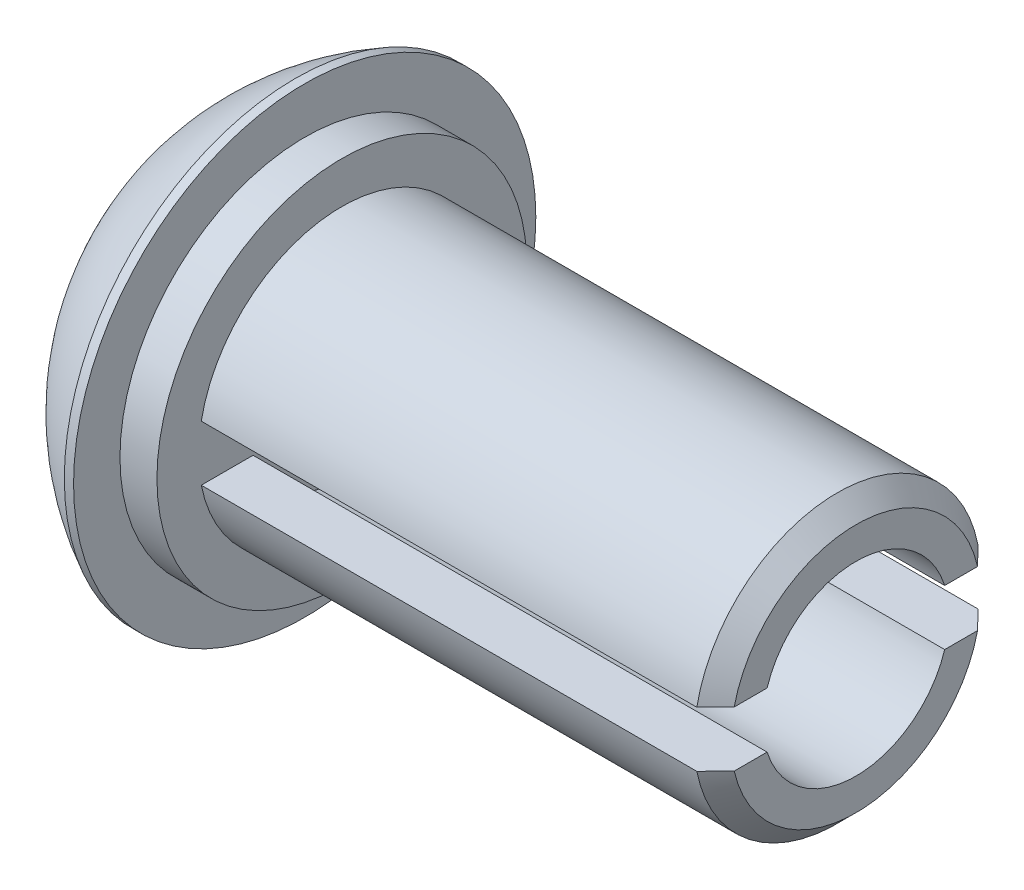
ISO-10303-21;
HEADER;
FILE_DESCRIPTION(('STEP AP214'),'2;1');
FILE_NAME('part.step','',(''),(''),'','','');
FILE_SCHEMA(('AUTOMOTIVE_DESIGN { 1 0 10303 214 1 1 1 1 }'));
ENDSEC;
DATA;
#1=APPLICATION_CONTEXT('core data for automotive mechanical design processes');
#2=APPLICATION_PROTOCOL_DEFINITION('international standard','automotive_design',2000,#1);
#3=PRODUCT_CONTEXT('',#1,'mechanical');
#4=PRODUCT('Part','Part','',(#3));
#5=PRODUCT_RELATED_PRODUCT_CATEGORY('part','',(#4));
#6=PRODUCT_DEFINITION_FORMATION('','',#4);
#7=PRODUCT_DEFINITION_CONTEXT('part definition',#1,'design');
#8=PRODUCT_DEFINITION('design','',#6,#7);
#9=PRODUCT_DEFINITION_SHAPE('','',#8);
#10=(LENGTH_UNIT() NAMED_UNIT(*) SI_UNIT(.MILLI.,.METRE.));
#11=(NAMED_UNIT(*) PLANE_ANGLE_UNIT() SI_UNIT($,.RADIAN.));
#12=(NAMED_UNIT(*) SI_UNIT($,.STERADIAN.) SOLID_ANGLE_UNIT());
#13=UNCERTAINTY_MEASURE_WITH_UNIT(LENGTH_MEASURE(1.E-05),#10,'distance_accuracy_value','');
#14=(GEOMETRIC_REPRESENTATION_CONTEXT(3) GLOBAL_UNCERTAINTY_ASSIGNED_CONTEXT((#13)) GLOBAL_UNIT_ASSIGNED_CONTEXT((#10,
#11,#12)) REPRESENTATION_CONTEXT('',''));
#15=CARTESIAN_POINT('',(0.,0.,0.));
#16=DIRECTION('',(0.,0.,1.));
#17=DIRECTION('',(1.,0.,0.));
#18=AXIS2_PLACEMENT_3D('',#15,#16,#17);
#19=CARTESIAN_POINT('',(0.,0.,0.));
#20=DIRECTION('',(-1.,0.,0.));
#21=DIRECTION('',(0.,0.,1.));
#22=AXIS2_PLACEMENT_3D('',#19,#20,#21);
#23=CYLINDRICAL_SURFACE('',#22,1.9685);
#24=CARTESIAN_POINT('',(9.40054,0.,0.));
#25=DIRECTION('',(-1.,0.,0.));
#26=DIRECTION('',(0.,0.,1.));
#27=AXIS2_PLACEMENT_3D('',#24,#25,#26);
#28=CIRCLE('',#27,1.9685);
#29=CARTESIAN_POINT('',(9.40054,0.381000000000001,1.93127710336968));
#30=VERTEX_POINT('',#29);
#31=CARTESIAN_POINT('',(9.40054,0.381000000000001,-1.93127710336968));
#32=VERTEX_POINT('',#31);
#33=EDGE_CURVE('E164',#30,#32,#28,.T.);
#34=ORIENTED_EDGE('',*,*,#33,.T.);
#35=DIRECTION('',(-1.,0.,0.));
#36=VECTOR('',#35,1.);
#37=CARTESIAN_POINT('',(0.,0.381000000000001,-1.93127710336968));
#38=LINE('',#37,#36);
#39=CARTESIAN_POINT('',(2.59334,0.381000000000001,-1.93127710336968));
#40=VERTEX_POINT('',#39);
#41=EDGE_CURVE('E229',#32,#40,#38,.T.);
#42=ORIENTED_EDGE('',*,*,#41,.T.);
#43=CARTESIAN_POINT('',(2.59334,0.,0.));
#44=DIRECTION('',(-1.,0.,0.));
#45=DIRECTION('',(0.,0.,1.));
#46=AXIS2_PLACEMENT_3D('',#43,#44,#45);
#47=CIRCLE('',#46,1.9685);
#48=CARTESIAN_POINT('',(2.59334,0.381000000000001,1.93127710336968));
#49=VERTEX_POINT('',#48);
#50=EDGE_CURVE('E142',#49,#40,#47,.T.);
#51=ORIENTED_EDGE('',*,*,#50,.F.);
#52=DIRECTION('',(-1.,0.,0.));
#53=VECTOR('',#52,1.);
#54=CARTESIAN_POINT('',(0.,0.381000000000001,1.93127710336968));
#55=LINE('',#54,#53);
#56=EDGE_CURVE('E220',#49,#30,#55,.F.);
#57=ORIENTED_EDGE('',*,*,#56,.T.);
#58=EDGE_LOOP('',(#34,#42,#51,#57));
#59=FACE_BOUND('',#58,.T.);
#60=ADVANCED_FACE('F30',(#59),#23,.T.);
#61=CARTESIAN_POINT('',(9.65454,1.9685,0.));
#62=DIRECTION('',(-1.,0.,0.));
#63=DIRECTION('',(0.,0.,1.));
#64=AXIS2_PLACEMENT_3D('',#61,#62,#63);
#65=PLANE('',#64);
#66=CARTESIAN_POINT('',(9.65454,0.,0.));
#67=DIRECTION('',(-1.,0.,0.));
#68=DIRECTION('',(0.,0.,1.));
#69=AXIS2_PLACEMENT_3D('',#66,#67,#68);
#70=CIRCLE('',#69,1.7145);
#71=CARTESIAN_POINT('',(9.65454,0.381000000000001,-1.6716307157982));
#72=VERTEX_POINT('',#71);
#73=CARTESIAN_POINT('',(9.65454,0.381000000000001,1.6716307157982));
#74=VERTEX_POINT('',#73);
#75=EDGE_CURVE('E167',#72,#74,#70,.F.);
#76=ORIENTED_EDGE('',*,*,#75,.T.);
#77=DIRECTION('',(0.,0.,1.));
#78=VECTOR('',#77,1.);
#79=CARTESIAN_POINT('',(9.65454,0.381000000000001,-3.175));
#80=LINE('',#79,#78);
#81=CARTESIAN_POINT('',(9.65454,0.381000000000001,1.21970071418776));
#82=VERTEX_POINT('',#81);
#83=EDGE_CURVE('E127',#82,#74,#80,.T.);
#84=ORIENTED_EDGE('',*,*,#83,.F.);
#85=CARTESIAN_POINT('',(9.65454,0.,0.));
#86=DIRECTION('',(-1.,0.,0.));
#87=DIRECTION('',(0.,0.,1.));
#88=AXIS2_PLACEMENT_3D('',#85,#86,#87);
#89=CIRCLE('',#88,1.277822692);
#90=CARTESIAN_POINT('',(9.65454,0.381000000000001,-1.21970071418776));
#91=VERTEX_POINT('',#90);
#92=EDGE_CURVE('E132',#82,#91,#89,.T.);
#93=ORIENTED_EDGE('',*,*,#92,.T.);
#94=EDGE_CURVE('E234',#72,#91,#80,.T.);
#95=ORIENTED_EDGE('',*,*,#94,.F.);
#96=EDGE_LOOP('',(#76,#84,#93,#95));
#97=FACE_BOUND('',#96,.T.);
#98=ADVANCED_FACE('F191',(#97),#65,.F.);
#99=CARTESIAN_POINT('',(0.,0.,0.));
#100=DIRECTION('',(-1.,0.,0.));
#101=DIRECTION('',(0.,0.,1.));
#102=AXIS2_PLACEMENT_3D('',#99,#100,#101);
#103=CYLINDRICAL_SURFACE('',#102,1.277822692);
#104=CARTESIAN_POINT('',(2.59334,0.,0.));
#105=DIRECTION('',(-1.,0.,0.));
#106=DIRECTION('',(0.,0.,1.));
#107=AXIS2_PLACEMENT_3D('',#104,#105,#106);
#108=CIRCLE('',#107,1.277822692);
#109=CARTESIAN_POINT('',(2.59334,0.381000000000001,1.21970071418776));
#110=VERTEX_POINT('',#109);
#111=CARTESIAN_POINT('',(2.59334,0.381000000000001,-1.21970071418776));
#112=VERTEX_POINT('',#111);
#113=EDGE_CURVE('E133',#110,#112,#108,.T.);
#114=ORIENTED_EDGE('',*,*,#113,.T.);
#115=DIRECTION('',(-1.,0.,0.));
#116=VECTOR('',#115,1.);
#117=CARTESIAN_POINT('',(0.,0.381000000000001,-1.21970071418776));
#118=LINE('',#117,#116);
#119=EDGE_CURVE('E250',#112,#91,#118,.F.);
#120=ORIENTED_EDGE('',*,*,#119,.T.);
#121=ORIENTED_EDGE('',*,*,#92,.F.);
#122=DIRECTION('',(-1.,0.,0.));
#123=VECTOR('',#122,1.);
#124=CARTESIAN_POINT('',(0.,0.381000000000001,1.21970071418776));
#125=LINE('',#124,#123);
#126=EDGE_CURVE('E248',#82,#110,#125,.T.);
#127=ORIENTED_EDGE('',*,*,#126,.T.);
#128=EDGE_LOOP('',(#114,#120,#121,#127));
#129=FACE_BOUND('',#128,.T.);
#130=ADVANCED_FACE('F198',(#129),#103,.F.);
#131=CARTESIAN_POINT('',(9.40054,0.,0.));
#132=DIRECTION('',(-1.,0.,0.));
#133=DIRECTION('',(0.,0.,1.));
#134=AXIS2_PLACEMENT_3D('',#131,#132,#133);
#135=CONICAL_SURFACE('',#134,1.9685,0.785398163397453);
#136=CARTESIAN_POINT('',(7.03322897598782,0.381000000000001,-4.31903880926599));
#137=CARTESIAN_POINT('',(7.1873440458186,0.381000000000001,-4.16431959154484));
#138=CARTESIAN_POINT('',(7.34143234496122,0.381000000000001,-4.00957365651349));
#139=CARTESIAN_POINT('',(7.64952770519312,0.381000000000001,-3.69998038506975));
#140=CARTESIAN_POINT('',(7.80353476017357,0.381000000000001,-3.54513304257858));
#141=CARTESIAN_POINT('',(8.11166528987143,0.381000000000001,-3.23506214672193));
#142=CARTESIAN_POINT('',(8.26578855750567,0.381000000000001,-3.07983838754255));
#143=CARTESIAN_POINT('',(8.5738243328161,0.381000000000001,-2.76920172554496));
#144=CARTESIAN_POINT('',(8.72773685352095,0.381000000000001,-2.61378883565545));
#145=CARTESIAN_POINT('',(9.0254961162365,0.381000000000001,-2.31247329107425));
#146=CARTESIAN_POINT('',(9.16936355869765,0.381000000000001,-2.1665910940783));
#147=CARTESIAN_POINT('',(9.45661240637948,0.381000000000001,-1.87429440553616));
#148=CARTESIAN_POINT('',(9.59999371640273,0.381000000000001,-1.72787982019204));
#149=CARTESIAN_POINT('',(9.81419045750005,0.381000000000001,-1.50754208565216));
#150=CARTESIAN_POINT('',(9.88540974031281,0.381000000000001,-1.43401210576863));
#151=CARTESIAN_POINT('',(10.0274245535608,0.381000000000001,-1.28653366680181));
#152=CARTESIAN_POINT('',(10.0982200529765,0.381000000000001,-1.21258517783748));
#153=CARTESIAN_POINT('',(10.2390892869109,0.381000000000001,-1.06404736885032));
#154=CARTESIAN_POINT('',(10.3091632584408,0.381000000000001,-0.989458275048335));
#155=CARTESIAN_POINT('',(10.4132743115276,0.381000000000001,-0.876658591297751));
#156=CARTESIAN_POINT('',(10.4478093442954,0.381000000000001,-0.83890826909454));
#157=CARTESIAN_POINT('',(10.51639097876,0.381000000000001,-0.762967228003849));
#158=CARTESIAN_POINT('',(10.5504376011495,0.381000000000001,-0.724776527898345));
#159=CARTESIAN_POINT('',(10.602948988222,0.381000000000001,-0.664712321848871));
#160=CARTESIAN_POINT('',(10.6216699576723,0.381000000000001,-0.64306305369018));
#161=CARTESIAN_POINT('',(10.6588068328657,0.381000000000001,-0.599500071332568));
#162=CARTESIAN_POINT('',(10.6772227084605,0.381000000000001,-0.577586331364926));
#163=CARTESIAN_POINT('',(10.7138508725208,0.381000000000001,-0.533171213701858));
#164=CARTESIAN_POINT('',(10.732058521268,0.381000000000001,-0.510665995714724));
#165=CARTESIAN_POINT('',(10.76789189048,0.381000000000001,-0.465203297570268));
#166=CARTESIAN_POINT('',(10.7855177507891,0.381000000000001,-0.442245928246361));
#167=CARTESIAN_POINT('',(10.8201660465319,0.381000000000001,-0.395415828798894));
#168=CARTESIAN_POINT('',(10.837177786518,0.381000000000001,-0.371535117540625));
#169=CARTESIAN_POINT('',(10.869956526613,0.381000000000001,-0.322874713558043));
#170=CARTESIAN_POINT('',(10.8857218270746,0.381000000000001,-0.298093858334898));
#171=CARTESIAN_POINT('',(10.9150903485082,0.381000000000001,-0.247641429940979));
#172=CARTESIAN_POINT('',(10.9287165692006,0.381000000000001,-0.221983557063495));
#173=CARTESIAN_POINT('',(10.9527950385943,0.381000000000001,-0.169252210428172));
#174=CARTESIAN_POINT('',(10.963257507732,0.381000000000001,-0.142183633499506));
#175=CARTESIAN_POINT('',(10.9785807249391,0.381000000000001,-0.0888206144294913));
#176=CARTESIAN_POINT('',(10.9838314924943,0.381000000000001,-0.0626456745336191));
#177=CARTESIAN_POINT('',(10.988808450214,0.381000000000001,-0.00984256357392038));
#178=CARTESIAN_POINT('',(10.9885575997649,0.381000000000001,0.0167832607445935));
#179=CARTESIAN_POINT('',(10.9826831468213,0.381000000000001,0.0692305638000328));
#180=CARTESIAN_POINT('',(10.9770915192009,0.381000000000001,0.0950558856018226));
#181=CARTESIAN_POINT('',(10.9657069175929,0.381000000000001,0.132907760176139));
#182=CARTESIAN_POINT('',(10.9613918454726,0.381000000000001,0.145420113806536));
#183=CARTESIAN_POINT('',(10.9519367181598,0.381000000000001,0.17012850761594));
#184=CARTESIAN_POINT('',(10.9467968065543,0.381000000000001,0.182324602420386));
#185=CARTESIAN_POINT('',(10.9311802201762,0.381000000000001,0.216698051612167));
#186=CARTESIAN_POINT('',(10.91989441487,0.381000000000001,0.238505081783863));
#187=CARTESIAN_POINT('',(10.8957941778372,0.381000000000001,0.281265929691707));
#188=CARTESIAN_POINT('',(10.8829779882684,0.381000000000001,0.302218728465148));
#189=CARTESIAN_POINT('',(10.8429151376682,0.381000000000001,0.364221860695579));
#190=CARTESIAN_POINT('',(10.8141306300792,0.381000000000001,0.404268307751705));
#191=CARTESIAN_POINT('',(10.7542600106227,0.381000000000001,0.483159969417149));
#192=CARTESIAN_POINT('',(10.7231541715596,0.381000000000001,0.521989639021346));
#193=CARTESIAN_POINT('',(10.6598248610941,0.381000000000001,0.59857032787666));
#194=CARTESIAN_POINT('',(10.6276042049822,0.381000000000001,0.636323679613915));
#195=CARTESIAN_POINT('',(10.5631404094603,0.381000000000001,0.710377125492755));
#196=CARTESIAN_POINT('',(10.5309129326086,0.381000000000001,0.746690977350253));
#197=CARTESIAN_POINT('',(10.4659872200818,0.381000000000001,0.818896216255431));
#198=CARTESIAN_POINT('',(10.433288973115,0.381000000000001,0.854787593132116));
#199=CARTESIAN_POINT('',(10.3347024157193,0.381000000000001,0.962026394460008));
#200=CARTESIAN_POINT('',(10.2683309959018,0.381000000000001,1.0329286686453));
#201=CARTESIAN_POINT('',(10.1348198341782,0.381000000000001,1.17416222196877));
#202=CARTESIAN_POINT('',(10.067679271089,0.381000000000001,1.24449272016551));
#203=CARTESIAN_POINT('',(9.93297569158913,0.381000000000001,1.38473755419932));
#204=CARTESIAN_POINT('',(9.86541270732938,0.381000000000001,1.45465192093669));
#205=CARTESIAN_POINT('',(9.66356038255316,0.381000000000001,1.66272134347647));
#206=CARTESIAN_POINT('',(9.52887573103025,0.381000000000001,1.80049235569314));
#207=CARTESIAN_POINT('',(9.25905036457502,0.381000000000001,2.07546841732816));
#208=CARTESIAN_POINT('',(9.12390987275753,0.381000000000001,2.21267368627995));
#209=CARTESIAN_POINT('',(8.8269433719988,0.381000000000001,2.51352100458013));
#210=CARTESIAN_POINT('',(8.66505342530933,0.381000000000001,2.67709993351504));
#211=CARTESIAN_POINT('',(8.34100738002163,0.381000000000001,3.00404432160756));
#212=CARTESIAN_POINT('',(8.17885124385022,0.381000000000001,3.16740974349135));
#213=CARTESIAN_POINT('',(7.85283022603036,0.381000000000001,3.49555786421106));
#214=CARTESIAN_POINT('',(7.68896388494447,0.381000000000001,3.66033911289186));
#215=CARTESIAN_POINT('',(7.36115107174126,0.381000000000001,3.98976954743593));
#216=CARTESIAN_POINT('',(7.19720461659162,0.381000000000001,4.15441875018195));
#217=CARTESIAN_POINT('',(7.03322897598782,0.381000000000001,4.31903880926599));
#218=B_SPLINE_CURVE_WITH_KNOTS('',3,(#136,#137,#138,#139,#140,#141,#142,#143,#144,#145,#146,
#147,#148,#149,#150,#151,#152,#153,#154,#155,#156,#157,#158,#159,#160,#161,#162,#163,#164,#165,
#166,#167,#168,#169,#170,#171,#172,#173,#174,#175,#176,#177,#178,#179,#180,#181,#182,#183,#184,
#185,#186,#187,#188,#189,#190,#191,#192,#193,#194,#195,#196,#197,#198,#199,#200,#201,#202,#203,
#204,#205,#206,#207,#208,#209,#210,#211,#212,#213,#214,#215,#216,#217),.UNSPECIFIED.,.F.,.F.,(4,
2,2,2,2,2,2,2,2,2,2,2,2,2,2,2,2,2,2,2,2,2,2,2,2,2,2,2,2,2,2,2,2,2,2,2,2,2,2,2,4),(0.,
0.655137765099666,1.31031925829353,1.96654746795722,2.62273309009145,3.23739939015551,
3.85217980996108,4.15927721457128,4.4663968293733,4.77341211690298,4.92690171474787,
5.08038479034737,5.16624591826245,5.25211548067328,5.33895365851682,5.42577080877684,
5.51370610675513,5.60175931637513,5.68878909971654,5.77553465530597,5.85514411060395,
5.9344214026868,6.01322702262444,6.05291210792994,6.09259029239121,6.16615186463677,
6.23979875957633,6.38759121026778,6.5368265809248,6.68570923316658,6.83136089232883,
6.97701605088099,7.26836573550003,7.56006254076802,7.85173740856013,8.4297368744141,
9.00748567549217,9.69791815665452,10.3884583235756,11.0856277791507,11.782685941497),.UNSPECIFIED.);
#219=EDGE_CURVE('E11',#32,#72,#218,.T.);
#220=ORIENTED_EDGE('',*,*,#219,.F.);
#221=ORIENTED_EDGE('',*,*,#33,.F.);
#222=EDGE_CURVE('E34',#74,#30,#218,.T.);
#223=ORIENTED_EDGE('',*,*,#222,.F.);
#224=ORIENTED_EDGE('',*,*,#75,.F.);
#225=EDGE_LOOP('',(#220,#221,#223,#224));
#226=FACE_BOUND('',#225,.T.);
#227=ADVANCED_FACE('F232',(#226),#135,.T.);
#228=CARTESIAN_POINT('',(3.55501038961039,0.,0.));
#229=DIRECTION('',(-1.,0.,0.));
#230=DIRECTION('',(0.,1.,0.));
#231=AXIS2_PLACEMENT_3D('',#228,#229,#230);
#232=SPHERICAL_SURFACE('',#231,3.55501038961039);
#233=CARTESIAN_POINT('',(1.9558,0.,0.));
#234=DIRECTION('',(-1.,0.,0.));
#235=DIRECTION('',(0.,0.,1.));
#236=AXIS2_PLACEMENT_3D('',#233,#234,#235);
#237=CIRCLE('',#236,3.175);
#238=CARTESIAN_POINT('',(1.9558,0.,3.175));
#239=VERTEX_POINT('',#238);
#240=EDGE_CURVE('E160',#239,#239,#237,.T.);
#241=ORIENTED_EDGE('',*,*,#240,.T.);
#242=EDGE_LOOP('',(#241));
#243=FACE_BOUND('',#242,.T.);
#244=ADVANCED_FACE('F32',(#243),#232,.T.);
#245=CARTESIAN_POINT('',(0.,0.,0.));
#246=DIRECTION('',(-1.,0.,0.));
#247=DIRECTION('',(0.,0.,1.));
#248=AXIS2_PLACEMENT_3D('',#245,#246,#247);
#249=CYLINDRICAL_SURFACE('',#248,3.175);
#250=ORIENTED_EDGE('',*,*,#240,.F.);
#251=EDGE_LOOP('',(#250));
#252=FACE_BOUND('',#251,.T.);
#253=CARTESIAN_POINT('',(2.0828,0.,0.));
#254=DIRECTION('',(-1.,0.,0.));
#255=DIRECTION('',(0.,0.,1.));
#256=AXIS2_PLACEMENT_3D('',#253,#254,#255);
#257=CIRCLE('',#256,3.175);
#258=CARTESIAN_POINT('',(2.0828,0.,3.175));
#259=VERTEX_POINT('',#258);
#260=EDGE_CURVE('E157',#259,#259,#257,.T.);
#261=ORIENTED_EDGE('',*,*,#260,.T.);
#262=EDGE_LOOP('',(#261));
#263=FACE_BOUND('',#262,.T.);
#264=ADVANCED_FACE('F274',(#252,#263),#249,.T.);
#265=CARTESIAN_POINT('',(2.0828,3.175,0.));
#266=DIRECTION('',(-1.,0.,0.));
#267=DIRECTION('',(0.,0.,1.));
#268=AXIS2_PLACEMENT_3D('',#265,#266,#267);
#269=PLANE('',#268);
#270=ORIENTED_EDGE('',*,*,#260,.F.);
#271=EDGE_LOOP('',(#270));
#272=FACE_BOUND('',#271,.T.);
#273=CARTESIAN_POINT('',(2.0828,0.,0.));
#274=DIRECTION('',(-1.,0.,0.));
#275=DIRECTION('',(0.,0.,1.));
#276=AXIS2_PLACEMENT_3D('',#273,#274,#275);
#277=CIRCLE('',#276,0.889);
#278=CARTESIAN_POINT('',(2.0828,0.,0.889));
#279=VERTEX_POINT('',#278);
#280=EDGE_CURVE('E154',#279,#279,#277,.T.);
#281=ORIENTED_EDGE('',*,*,#280,.T.);
#282=EDGE_LOOP('',(#281));
#283=FACE_BOUND('',#282,.T.);
#284=ADVANCED_FACE('F279',(#272,#283),#269,.F.);
#285=CARTESIAN_POINT('',(0.,0.,0.));
#286=DIRECTION('',(-1.,0.,0.));
#287=DIRECTION('',(0.,0.,1.));
#288=AXIS2_PLACEMENT_3D('',#285,#286,#287);
#289=CYLINDRICAL_SURFACE('',#288,0.889);
#290=ORIENTED_EDGE('',*,*,#280,.F.);
#291=EDGE_LOOP('',(#290));
#292=FACE_BOUND('',#291,.T.);
#293=CARTESIAN_POINT('',(2.08534,0.,0.));
#294=DIRECTION('',(-1.,0.,0.));
#295=DIRECTION('',(0.,0.,1.));
#296=AXIS2_PLACEMENT_3D('',#293,#294,#295);
#297=CIRCLE('',#296,0.889);
#298=CARTESIAN_POINT('',(2.08534,0.,0.889));
#299=VERTEX_POINT('',#298);
#300=EDGE_CURVE('E151',#299,#299,#297,.T.);
#301=ORIENTED_EDGE('',*,*,#300,.T.);
#302=EDGE_LOOP('',(#301));
#303=FACE_BOUND('',#302,.T.);
#304=ADVANCED_FACE('F287',(#292,#303),#289,.T.);
#305=CARTESIAN_POINT('',(2.08534,0.889,0.));
#306=DIRECTION('',(1.,0.,0.));
#307=DIRECTION('',(0.,0.,-1.));
#308=AXIS2_PLACEMENT_3D('',#305,#306,#307);
#309=PLANE('',#308);
#310=ORIENTED_EDGE('',*,*,#300,.F.);
#311=EDGE_LOOP('',(#310));
#312=FACE_BOUND('',#311,.T.);
#313=CARTESIAN_POINT('',(2.08534,0.,0.));
#314=DIRECTION('',(-1.,0.,0.));
#315=DIRECTION('',(0.,0.,1.));
#316=AXIS2_PLACEMENT_3D('',#313,#314,#315);
#317=CIRCLE('',#316,2.54);
#318=CARTESIAN_POINT('',(2.08534,0.,2.54));
#319=VERTEX_POINT('',#318);
#320=EDGE_CURVE('E148',#319,#319,#317,.T.);
#321=ORIENTED_EDGE('',*,*,#320,.T.);
#322=EDGE_LOOP('',(#321));
#323=FACE_BOUND('',#322,.T.);
#324=ADVANCED_FACE('F209',(#312,#323),#309,.F.);
#325=CARTESIAN_POINT('',(0.,0.,0.));
#326=DIRECTION('',(-1.,0.,0.));
#327=DIRECTION('',(0.,0.,1.));
#328=AXIS2_PLACEMENT_3D('',#325,#326,#327);
#329=CYLINDRICAL_SURFACE('',#328,2.54);
#330=ORIENTED_EDGE('',*,*,#320,.F.);
#331=EDGE_LOOP('',(#330));
#332=FACE_BOUND('',#331,.T.);
#333=CARTESIAN_POINT('',(2.59334,0.,0.));
#334=DIRECTION('',(-1.,0.,0.));
#335=DIRECTION('',(0.,0.,1.));
#336=AXIS2_PLACEMENT_3D('',#333,#334,#335);
#337=CIRCLE('',#336,2.54);
#338=CARTESIAN_POINT('',(2.59334,0.,2.54));
#339=VERTEX_POINT('',#338);
#340=EDGE_CURVE('E145',#339,#339,#337,.T.);
#341=ORIENTED_EDGE('',*,*,#340,.T.);
#342=EDGE_LOOP('',(#341));
#343=FACE_BOUND('',#342,.T.);
#344=ADVANCED_FACE('F203',(#332,#343),#329,.T.);
#345=CARTESIAN_POINT('',(9.40054,-0.380999999999995,-1.93127710336969));
#346=VERTEX_POINT('',#345);
#347=CARTESIAN_POINT('',(9.40054,-0.380999999999995,1.93127710336969));
#348=VERTEX_POINT('',#347);
#349=EDGE_CURVE('E163',#346,#348,#28,.T.);
#350=ORIENTED_EDGE('',*,*,#349,.T.);
#351=DIRECTION('',(-1.,0.,0.));
#352=VECTOR('',#351,1.);
#353=CARTESIAN_POINT('',(0.,-0.381000000000001,1.93127710336968));
#354=LINE('',#353,#352);
#355=CARTESIAN_POINT('',(2.59334,-0.380999999999999,1.93127710336968));
#356=VERTEX_POINT('',#355);
#357=EDGE_CURVE('E50',#348,#356,#354,.T.);
#358=ORIENTED_EDGE('',*,*,#357,.T.);
#359=CARTESIAN_POINT('',(2.59334,-0.380999999999999,-1.93127710336968));
#360=VERTEX_POINT('',#359);
#361=EDGE_CURVE('E136',#360,#356,#47,.T.);
#362=ORIENTED_EDGE('',*,*,#361,.F.);
#363=DIRECTION('',(-1.,0.,0.));
#364=VECTOR('',#363,1.);
#365=CARTESIAN_POINT('',(0.,-0.381000000000001,-1.93127710336968));
#366=LINE('',#365,#364);
#367=EDGE_CURVE('E216',#360,#346,#366,.F.);
#368=ORIENTED_EDGE('',*,*,#367,.T.);
#369=EDGE_LOOP('',(#350,#358,#362,#368));
#370=FACE_BOUND('',#369,.T.);
#371=ADVANCED_FACE('F194',(#370),#23,.T.);
#372=CARTESIAN_POINT('',(9.65454,-0.380999999999995,1.6716307157982));
#373=VERTEX_POINT('',#372);
#374=CARTESIAN_POINT('',(9.65454,-0.380999999999995,-1.6716307157982));
#375=VERTEX_POINT('',#374);
#376=EDGE_CURVE('E126',#373,#375,#70,.F.);
#377=ORIENTED_EDGE('',*,*,#376,.T.);
#378=DIRECTION('',(0.,0.,1.));
#379=VECTOR('',#378,1.);
#380=CARTESIAN_POINT('',(9.65454,-0.380999999999995,-3.175));
#381=LINE('',#380,#379);
#382=CARTESIAN_POINT('',(9.65454,-0.380999999999995,-1.21970071418776));
#383=VERTEX_POINT('',#382);
#384=EDGE_CURVE('E58',#375,#383,#381,.T.);
#385=ORIENTED_EDGE('',*,*,#384,.T.);
#386=CARTESIAN_POINT('',(9.65454,-0.380999999999995,1.21970071418776));
#387=VERTEX_POINT('',#386);
#388=EDGE_CURVE('E124',#383,#387,#89,.T.);
#389=ORIENTED_EDGE('',*,*,#388,.T.);
#390=EDGE_CURVE('E128',#387,#373,#381,.T.);
#391=ORIENTED_EDGE('',*,*,#390,.T.);
#392=EDGE_LOOP('',(#377,#385,#389,#391));
#393=FACE_BOUND('',#392,.T.);
#394=ADVANCED_FACE('F122',(#393),#65,.F.);
#395=CARTESIAN_POINT('',(2.59334,-0.380999999999999,-1.21970071418776));
#396=VERTEX_POINT('',#395);
#397=CARTESIAN_POINT('',(2.59334,-0.380999999999999,1.21970071418776));
#398=VERTEX_POINT('',#397);
#399=EDGE_CURVE('E138',#396,#398,#108,.T.);
#400=ORIENTED_EDGE('',*,*,#399,.T.);
#401=DIRECTION('',(-1.,0.,0.));
#402=VECTOR('',#401,1.);
#403=CARTESIAN_POINT('',(0.,-0.381000000000001,1.21970071418776));
#404=LINE('',#403,#402);
#405=EDGE_CURVE('E117',#398,#387,#404,.F.);
#406=ORIENTED_EDGE('',*,*,#405,.T.);
#407=ORIENTED_EDGE('',*,*,#388,.F.);
#408=DIRECTION('',(-1.,0.,0.));
#409=VECTOR('',#408,1.);
#410=CARTESIAN_POINT('',(0.,-0.381000000000001,-1.21970071418776));
#411=LINE('',#410,#409);
#412=EDGE_CURVE('E109',#383,#396,#411,.T.);
#413=ORIENTED_EDGE('',*,*,#412,.T.);
#414=EDGE_LOOP('',(#400,#406,#407,#413));
#415=FACE_BOUND('',#414,.T.);
#416=ADVANCED_FACE('F131',(#415),#103,.F.);
#417=CARTESIAN_POINT('',(2.59334,1.277822692,0.));
#418=DIRECTION('',(-1.,0.,0.));
#419=DIRECTION('',(0.,0.,1.));
#420=AXIS2_PLACEMENT_3D('',#417,#418,#419);
#421=PLANE('',#420);
#422=DIRECTION('',(0.,0.,1.));
#423=VECTOR('',#422,1.);
#424=CARTESIAN_POINT('',(2.59334,0.381000000000001,-3.175));
#425=LINE('',#424,#423);
#426=EDGE_CURVE('E237',#110,#49,#425,.T.);
#427=ORIENTED_EDGE('',*,*,#426,.T.);
#428=ORIENTED_EDGE('',*,*,#50,.T.);
#429=EDGE_CURVE('E239',#40,#112,#425,.T.);
#430=ORIENTED_EDGE('',*,*,#429,.T.);
#431=ORIENTED_EDGE('',*,*,#113,.F.);
#432=EDGE_LOOP('',(#427,#428,#430,#431));
#433=FACE_BOUND('',#432,.T.);
#434=DIRECTION('',(0.,0.,1.));
#435=VECTOR('',#434,1.);
#436=CARTESIAN_POINT('',(2.59334,-0.380999999999999,-3.175));
#437=LINE('',#436,#435);
#438=EDGE_CURVE('E112',#360,#396,#437,.T.);
#439=ORIENTED_EDGE('',*,*,#438,.F.);
#440=ORIENTED_EDGE('',*,*,#361,.T.);
#441=EDGE_CURVE('E242',#398,#356,#437,.T.);
#442=ORIENTED_EDGE('',*,*,#441,.F.);
#443=ORIENTED_EDGE('',*,*,#399,.F.);
#444=EDGE_LOOP('',(#439,#440,#442,#443));
#445=FACE_BOUND('',#444,.T.);
#446=ORIENTED_EDGE('',*,*,#340,.F.);
#447=EDGE_LOOP('',(#446));
#448=FACE_BOUND('',#447,.T.);
#449=ADVANCED_FACE('F254',(#433,#445,#448),#421,.F.);
#450=CARTESIAN_POINT('',(7.03322897598781,-0.380999999999997,4.31903880926599));
#451=CARTESIAN_POINT('',(7.1873440458186,-0.380999999999997,4.16431959154484));
#452=CARTESIAN_POINT('',(7.34143234496122,-0.380999999999997,4.00957365651349));
#453=CARTESIAN_POINT('',(7.64952770519312,-0.380999999999996,3.69998038506975));
#454=CARTESIAN_POINT('',(7.80353476017358,-0.380999999999996,3.54513304257858));
#455=CARTESIAN_POINT('',(8.11166528987143,-0.380999999999996,3.23506214672192));
#456=CARTESIAN_POINT('',(8.26578855750568,-0.380999999999996,3.07983838754254));
#457=CARTESIAN_POINT('',(8.57382433281611,-0.380999999999996,2.76920172554495));
#458=CARTESIAN_POINT('',(8.72773685352096,-0.380999999999996,2.61378883565544));
#459=CARTESIAN_POINT('',(9.02549611623651,-0.380999999999995,2.31247329107424));
#460=CARTESIAN_POINT('',(9.16936355869766,-0.380999999999995,2.16659109407829));
#461=CARTESIAN_POINT('',(9.45661240637949,-0.380999999999995,1.87429440553615));
#462=CARTESIAN_POINT('',(9.59999371640274,-0.380999999999995,1.72787982019203));
#463=CARTESIAN_POINT('',(9.81419045750006,-0.380999999999995,1.50754208565215));
#464=CARTESIAN_POINT('',(9.88540974031282,-0.380999999999995,1.43401210576862));
#465=CARTESIAN_POINT('',(10.0274245535608,-0.380999999999995,1.28653366680181));
#466=CARTESIAN_POINT('',(10.0982200529765,-0.380999999999995,1.21258517783748));
#467=CARTESIAN_POINT('',(10.2390892869109,-0.380999999999995,1.06404736885032));
#468=CARTESIAN_POINT('',(10.3091632584408,-0.380999999999995,0.989458275048333));
#469=CARTESIAN_POINT('',(10.4132743115276,-0.380999999999995,0.876658591297751));
#470=CARTESIAN_POINT('',(10.4478093442954,-0.380999999999995,0.83890826909454));
#471=CARTESIAN_POINT('',(10.51639097876,-0.380999999999995,0.76296722800385));
#472=CARTESIAN_POINT('',(10.5504376011495,-0.380999999999994,0.724776527898346));
#473=CARTESIAN_POINT('',(10.602948988222,-0.380999999999994,0.664712321848872));
#474=CARTESIAN_POINT('',(10.6216699576723,-0.380999999999994,0.643063053690181));
#475=CARTESIAN_POINT('',(10.6588068328657,-0.380999999999994,0.599500071332569));
#476=CARTESIAN_POINT('',(10.6772227084605,-0.380999999999994,0.577586331364927));
#477=CARTESIAN_POINT('',(10.7138508725208,-0.380999999999994,0.53317121370186));
#478=CARTESIAN_POINT('',(10.732058521268,-0.380999999999994,0.510665995714726));
#479=CARTESIAN_POINT('',(10.76789189048,-0.380999999999994,0.46520329757027));
#480=CARTESIAN_POINT('',(10.7855177507891,-0.380999999999994,0.442245928246363));
#481=CARTESIAN_POINT('',(10.8201660465319,-0.380999999999994,0.395415828798897));
#482=CARTESIAN_POINT('',(10.837177786518,-0.380999999999994,0.371535117540628));
#483=CARTESIAN_POINT('',(10.869956526613,-0.380999999999994,0.322874713558047));
#484=CARTESIAN_POINT('',(10.8857218270746,-0.380999999999994,0.298093858334901));
#485=CARTESIAN_POINT('',(10.9150903485082,-0.380999999999994,0.247641429940983));
#486=CARTESIAN_POINT('',(10.9287165692006,-0.380999999999994,0.221983557063499));
#487=CARTESIAN_POINT('',(10.9527950385943,-0.380999999999994,0.169252210428176));
#488=CARTESIAN_POINT('',(10.963257507732,-0.380999999999994,0.142183633499511));
#489=CARTESIAN_POINT('',(10.9785807249391,-0.380999999999994,0.088820614429496));
#490=CARTESIAN_POINT('',(10.9838314924943,-0.380999999999994,0.0626456745336239));
#491=CARTESIAN_POINT('',(10.9888084502141,-0.380999999999994,0.00984256357392512));
#492=CARTESIAN_POINT('',(10.9885575997649,-0.380999999999994,-0.0167832607445888));
#493=CARTESIAN_POINT('',(10.9826831468213,-0.380999999999994,-0.069230563800028));
#494=CARTESIAN_POINT('',(10.9770915192009,-0.380999999999994,-0.0950558856018175));
#495=CARTESIAN_POINT('',(10.9657069175929,-0.380999999999994,-0.132907760176134));
#496=CARTESIAN_POINT('',(10.9613918454726,-0.380999999999994,-0.145420113806531));
#497=CARTESIAN_POINT('',(10.9519367181598,-0.380999999999994,-0.170128507615935));
#498=CARTESIAN_POINT('',(10.9467968065543,-0.380999999999994,-0.182324602420382));
#499=CARTESIAN_POINT('',(10.9311802201762,-0.380999999999994,-0.216698051612161));
#500=CARTESIAN_POINT('',(10.91989441487,-0.380999999999994,-0.238505081783857));
#501=CARTESIAN_POINT('',(10.8957941778372,-0.380999999999994,-0.281265929691699));
#502=CARTESIAN_POINT('',(10.8829779882684,-0.380999999999994,-0.302218728465138));
#503=CARTESIAN_POINT('',(10.8429151376682,-0.380999999999994,-0.364221860695568));
#504=CARTESIAN_POINT('',(10.8141306300792,-0.380999999999994,-0.404268307751693));
#505=CARTESIAN_POINT('',(10.7542600106227,-0.380999999999994,-0.483159969417135));
#506=CARTESIAN_POINT('',(10.7231541715596,-0.380999999999994,-0.521989639021331));
#507=CARTESIAN_POINT('',(10.6598248610941,-0.380999999999994,-0.598570327876642));
#508=CARTESIAN_POINT('',(10.6276042049823,-0.380999999999994,-0.636323679613896));
#509=CARTESIAN_POINT('',(10.5631404094604,-0.380999999999994,-0.710377125492733));
#510=CARTESIAN_POINT('',(10.5309129326086,-0.380999999999995,-0.746690977350231));
#511=CARTESIAN_POINT('',(10.4659872200818,-0.380999999999995,-0.818896216255406));
#512=CARTESIAN_POINT('',(10.433288973115,-0.380999999999995,-0.85478759313209));
#513=CARTESIAN_POINT('',(10.3347024157193,-0.380999999999995,-0.962026394459978));
#514=CARTESIAN_POINT('',(10.2683309959019,-0.380999999999995,-1.03292866864527));
#515=CARTESIAN_POINT('',(10.1348198341783,-0.380999999999995,-1.17416222196874));
#516=CARTESIAN_POINT('',(10.0676792710891,-0.380999999999995,-1.24449272016547));
#517=CARTESIAN_POINT('',(9.93297569158917,-0.380999999999995,-1.38473755419927));
#518=CARTESIAN_POINT('',(9.86541270732942,-0.380999999999995,-1.45465192093664));
#519=CARTESIAN_POINT('',(9.66356038255322,-0.380999999999995,-1.66272134347642));
#520=CARTESIAN_POINT('',(9.52887573103031,-0.380999999999995,-1.80049235569308));
#521=CARTESIAN_POINT('',(9.25905036457508,-0.380999999999995,-2.0754684173281));
#522=CARTESIAN_POINT('',(9.1239098727576,-0.380999999999995,-2.21267368627988));
#523=CARTESIAN_POINT('',(8.82694337199887,-0.380999999999996,-2.51352100458006));
#524=CARTESIAN_POINT('',(8.6650534253094,-0.380999999999996,-2.67709993351497));
#525=CARTESIAN_POINT('',(8.34100738002168,-0.380999999999996,-3.00404432160751));
#526=CARTESIAN_POINT('',(8.17885124385026,-0.380999999999996,-3.16740974349131));
#527=CARTESIAN_POINT('',(7.85283022603039,-0.380999999999996,-3.49555786421103));
#528=CARTESIAN_POINT('',(7.6889638849445,-0.380999999999996,-3.66033911289184));
#529=CARTESIAN_POINT('',(7.36115107174127,-0.380999999999996,-3.98976954743592));
#530=CARTESIAN_POINT('',(7.19720461659163,-0.380999999999997,-4.15441875018195));
#531=CARTESIAN_POINT('',(7.03322897598781,-0.380999999999997,-4.31903880926599));
#532=B_SPLINE_CURVE_WITH_KNOTS('',3,(#450,#451,#452,#453,#454,#455,#456,#457,#458,#459,#460,
#461,#462,#463,#464,#465,#466,#467,#468,#469,#470,#471,#472,#473,#474,#475,#476,#477,#478,#479,
#480,#481,#482,#483,#484,#485,#486,#487,#488,#489,#490,#491,#492,#493,#494,#495,#496,#497,#498,
#499,#500,#501,#502,#503,#504,#505,#506,#507,#508,#509,#510,#511,#512,#513,#514,#515,#516,#517,
#518,#519,#520,#521,#522,#523,#524,#525,#526,#527,#528,#529,#530,#531),.UNSPECIFIED.,.F.,.F.,(4,
2,2,2,2,2,2,2,2,2,2,2,2,2,2,2,2,2,2,2,2,2,2,2,2,2,2,2,2,2,2,2,2,2,2,2,2,2,2,2,4),(0.,
0.655137765099674,1.31031925829354,1.96654746795723,2.62273309009148,3.23739939015553,
3.8521798099611,4.15927721457129,4.46639682937331,4.77341211690299,4.92690171474787,
5.08038479034737,5.16624591826246,5.25211548067328,5.33895365851682,5.42577080877685,
5.51370610675513,5.60175931637513,5.68878909971654,5.77553465530597,5.85514411060395,
5.93442140268681,6.01322702262444,6.05291210792994,6.09259029239122,6.16615186463677,
6.23979875957633,6.38759121026778,6.53682658092479,6.68570923316656,6.83136089232881,
6.97701605088097,7.2683657355,7.56006254076797,7.85173740856007,8.42973687441403,
9.00748567549208,9.69791815665445,10.3884583235756,11.0856277791507,11.782685941497),.UNSPECIFIED.);
#533=EDGE_CURVE('E173',#348,#373,#532,.T.);
#534=ORIENTED_EDGE('',*,*,#533,.F.);
#535=ORIENTED_EDGE('',*,*,#349,.F.);
#536=EDGE_CURVE('E168',#375,#346,#532,.T.);
#537=ORIENTED_EDGE('',*,*,#536,.F.);
#538=ORIENTED_EDGE('',*,*,#376,.F.);
#539=EDGE_LOOP('',(#534,#535,#537,#538));
#540=FACE_BOUND('',#539,.T.);
#541=ADVANCED_FACE('F174',(#540),#135,.T.);
#542=CARTESIAN_POINT('',(2.59334,-0.380999999999999,-3.175));
#543=DIRECTION('',(0.,-1.,0.));
#544=DIRECTION('',(1.,0.,0.));
#545=AXIS2_PLACEMENT_3D('',#542,#543,#544);
#546=PLANE('',#545);
#547=ORIENTED_EDGE('',*,*,#384,.F.);
#548=ORIENTED_EDGE('',*,*,#536,.T.);
#549=ORIENTED_EDGE('',*,*,#367,.F.);
#550=ORIENTED_EDGE('',*,*,#438,.T.);
#551=ORIENTED_EDGE('',*,*,#412,.F.);
#552=EDGE_LOOP('',(#547,#548,#549,#550,#551));
#553=FACE_BOUND('',#552,.T.);
#554=ADVANCED_FACE('F110',(#553),#546,.F.);
#555=CARTESIAN_POINT('',(2.59334,0.381000000000001,-3.175));
#556=DIRECTION('',(0.,1.,0.));
#557=DIRECTION('',(-1.,0.,0.));
#558=AXIS2_PLACEMENT_3D('',#555,#556,#557);
#559=PLANE('',#558);
#560=ORIENTED_EDGE('',*,*,#429,.F.);
#561=ORIENTED_EDGE('',*,*,#41,.F.);
#562=ORIENTED_EDGE('',*,*,#219,.T.);
#563=ORIENTED_EDGE('',*,*,#94,.T.);
#564=ORIENTED_EDGE('',*,*,#119,.F.);
#565=EDGE_LOOP('',(#560,#561,#562,#563,#564));
#566=FACE_BOUND('',#565,.T.);
#567=ADVANCED_FACE('F181',(#566),#559,.F.);
#568=ORIENTED_EDGE('',*,*,#83,.T.);
#569=ORIENTED_EDGE('',*,*,#222,.T.);
#570=ORIENTED_EDGE('',*,*,#56,.F.);
#571=ORIENTED_EDGE('',*,*,#426,.F.);
#572=ORIENTED_EDGE('',*,*,#126,.F.);
#573=EDGE_LOOP('',(#568,#569,#570,#571,#572));
#574=FACE_BOUND('',#573,.T.);
#575=ADVANCED_FACE('F180',(#574),#559,.F.);
#576=ORIENTED_EDGE('',*,*,#441,.T.);
#577=ORIENTED_EDGE('',*,*,#357,.F.);
#578=ORIENTED_EDGE('',*,*,#533,.T.);
#579=ORIENTED_EDGE('',*,*,#390,.F.);
#580=ORIENTED_EDGE('',*,*,#405,.F.);
#581=EDGE_LOOP('',(#576,#577,#578,#579,#580));
#582=FACE_BOUND('',#581,.T.);
#583=ADVANCED_FACE('F177',(#582),#546,.F.);
#584=CLOSED_SHELL('',(#60,#98,#130,#227,#244,#264,#284,#304,#324,#344,#371,#394,#416,#449,#541,
#554,#567,#575,#583));
#585=MANIFOLD_SOLID_BREP('B2',#584);
#586=ADVANCED_BREP_SHAPE_REPRESENTATION('',(#18,#585),#14);
#587=SHAPE_DEFINITION_REPRESENTATION(#9,#586);
ENDSEC;
END-ISO-10303-21;
